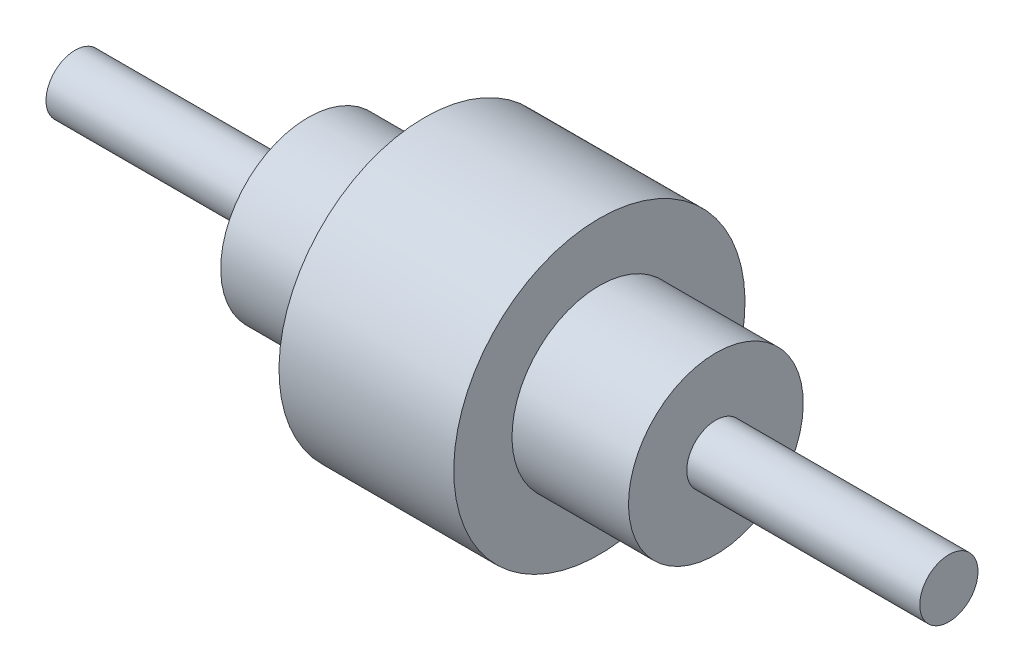
ISO-10303-21;
HEADER;
FILE_DESCRIPTION(('STEP AP214'),'2;1');
FILE_NAME('part.step','',(''),(''),'','','');
FILE_SCHEMA(('AUTOMOTIVE_DESIGN { 1 0 10303 214 1 1 1 1 }'));
ENDSEC;
DATA;
#1=APPLICATION_CONTEXT('core data for automotive mechanical design processes');
#2=APPLICATION_PROTOCOL_DEFINITION('international standard','automotive_design',2000,#1);
#3=PRODUCT_CONTEXT('',#1,'mechanical');
#4=PRODUCT('Part','Part','',(#3));
#5=PRODUCT_RELATED_PRODUCT_CATEGORY('part','',(#4));
#6=PRODUCT_DEFINITION_FORMATION('','',#4);
#7=PRODUCT_DEFINITION_CONTEXT('part definition',#1,'design');
#8=PRODUCT_DEFINITION('design','',#6,#7);
#9=PRODUCT_DEFINITION_SHAPE('','',#8);
#10=(LENGTH_UNIT() NAMED_UNIT(*) SI_UNIT(.MILLI.,.METRE.));
#11=(NAMED_UNIT(*) PLANE_ANGLE_UNIT() SI_UNIT($,.RADIAN.));
#12=(NAMED_UNIT(*) SI_UNIT($,.STERADIAN.) SOLID_ANGLE_UNIT());
#13=UNCERTAINTY_MEASURE_WITH_UNIT(LENGTH_MEASURE(1.E-05),#10,'distance_accuracy_value','');
#14=(GEOMETRIC_REPRESENTATION_CONTEXT(3) GLOBAL_UNCERTAINTY_ASSIGNED_CONTEXT((#13)) GLOBAL_UNIT_ASSIGNED_CONTEXT((#10,
#11,#12)) REPRESENTATION_CONTEXT('',''));
#15=CARTESIAN_POINT('',(0.,0.,0.));
#16=DIRECTION('',(0.,0.,1.));
#17=DIRECTION('',(1.,0.,0.));
#18=AXIS2_PLACEMENT_3D('',#15,#16,#17);
#19=CARTESIAN_POINT('',(150.,0.,0.));
#20=DIRECTION('',(1.,0.,0.));
#21=DIRECTION('',(0.,1.,0.));
#22=AXIS2_PLACEMENT_3D('',#19,#20,#21);
#23=CYLINDRICAL_SURFACE('',#22,50.);
#24=CARTESIAN_POINT('',(-30.,0.,0.));
#25=DIRECTION('',(1.,0.,0.));
#26=DIRECTION('',(0.,1.,0.));
#27=AXIS2_PLACEMENT_3D('',#24,#25,#26);
#28=CIRCLE('',#27,50.);
#29=CARTESIAN_POINT('',(-30.,50.,0.));
#30=VERTEX_POINT('',#29);
#31=EDGE_CURVE('E65',#30,#30,#28,.T.);
#32=ORIENTED_EDGE('',*,*,#31,.T.);
#33=EDGE_LOOP('',(#32));
#34=FACE_BOUND('',#33,.T.);
#35=CARTESIAN_POINT('',(30.,0.,0.));
#36=DIRECTION('',(1.,0.,0.));
#37=DIRECTION('',(0.,1.,0.));
#38=AXIS2_PLACEMENT_3D('',#35,#36,#37);
#39=CIRCLE('',#38,50.);
#40=CARTESIAN_POINT('',(30.,50.,0.));
#41=VERTEX_POINT('',#40);
#42=EDGE_CURVE('E10',#41,#41,#39,.T.);
#43=ORIENTED_EDGE('',*,*,#42,.F.);
#44=EDGE_LOOP('',(#43));
#45=FACE_BOUND('',#44,.T.);
#46=ADVANCED_FACE('F31',(#34,#45),#23,.T.);
#47=CARTESIAN_POINT('',(30.,50.,0.));
#48=DIRECTION('',(1.,0.,0.));
#49=DIRECTION('',(0.,1.,0.));
#50=AXIS2_PLACEMENT_3D('',#47,#48,#49);
#51=PLANE('',#50);
#52=ORIENTED_EDGE('',*,*,#42,.T.);
#53=EDGE_LOOP('',(#52));
#54=FACE_BOUND('',#53,.T.);
#55=CARTESIAN_POINT('',(30.,0.,0.));
#56=DIRECTION('',(1.,0.,0.));
#57=DIRECTION('',(0.,1.,0.));
#58=AXIS2_PLACEMENT_3D('',#55,#56,#57);
#59=CIRCLE('',#58,30.);
#60=CARTESIAN_POINT('',(30.,30.,0.));
#61=VERTEX_POINT('',#60);
#62=EDGE_CURVE('E37',#61,#61,#59,.T.);
#63=ORIENTED_EDGE('',*,*,#62,.F.);
#64=EDGE_LOOP('',(#63));
#65=FACE_BOUND('',#64,.T.);
#66=ADVANCED_FACE('F83',(#54,#65),#51,.T.);
#67=CARTESIAN_POINT('',(150.,0.,0.));
#68=DIRECTION('',(1.,0.,0.));
#69=DIRECTION('',(0.,1.,0.));
#70=AXIS2_PLACEMENT_3D('',#67,#68,#69);
#71=CYLINDRICAL_SURFACE('',#70,30.);
#72=ORIENTED_EDGE('',*,*,#62,.T.);
#73=EDGE_LOOP('',(#72));
#74=FACE_BOUND('',#73,.T.);
#75=CARTESIAN_POINT('',(70.,0.,0.));
#76=DIRECTION('',(1.,0.,0.));
#77=DIRECTION('',(0.,1.,0.));
#78=AXIS2_PLACEMENT_3D('',#75,#76,#77);
#79=CIRCLE('',#78,30.);
#80=CARTESIAN_POINT('',(70.,30.,0.));
#81=VERTEX_POINT('',#80);
#82=EDGE_CURVE('E41',#81,#81,#79,.T.);
#83=ORIENTED_EDGE('',*,*,#82,.F.);
#84=EDGE_LOOP('',(#83));
#85=FACE_BOUND('',#84,.T.);
#86=ADVANCED_FACE('F87',(#74,#85),#71,.T.);
#87=CARTESIAN_POINT('',(70.,30.,0.));
#88=DIRECTION('',(1.,0.,0.));
#89=DIRECTION('',(0.,1.,0.));
#90=AXIS2_PLACEMENT_3D('',#87,#88,#89);
#91=PLANE('',#90);
#92=ORIENTED_EDGE('',*,*,#82,.T.);
#93=EDGE_LOOP('',(#92));
#94=FACE_BOUND('',#93,.T.);
#95=CARTESIAN_POINT('',(70.,0.,0.));
#96=DIRECTION('',(1.,0.,0.));
#97=DIRECTION('',(0.,1.,0.));
#98=AXIS2_PLACEMENT_3D('',#95,#96,#97);
#99=CIRCLE('',#98,10.);
#100=CARTESIAN_POINT('',(70.,10.,0.));
#101=VERTEX_POINT('',#100);
#102=EDGE_CURVE('E45',#101,#101,#99,.T.);
#103=ORIENTED_EDGE('',*,*,#102,.F.);
#104=EDGE_LOOP('',(#103));
#105=FACE_BOUND('',#104,.T.);
#106=ADVANCED_FACE('F91',(#94,#105),#91,.T.);
#107=CARTESIAN_POINT('',(150.,0.,0.));
#108=DIRECTION('',(1.,0.,0.));
#109=DIRECTION('',(0.,1.,0.));
#110=AXIS2_PLACEMENT_3D('',#107,#108,#109);
#111=CYLINDRICAL_SURFACE('',#110,10.);
#112=ORIENTED_EDGE('',*,*,#102,.T.);
#113=EDGE_LOOP('',(#112));
#114=FACE_BOUND('',#113,.T.);
#115=CARTESIAN_POINT('',(150.,0.,0.));
#116=DIRECTION('',(1.,0.,0.));
#117=DIRECTION('',(0.,1.,0.));
#118=AXIS2_PLACEMENT_3D('',#115,#116,#117);
#119=CIRCLE('',#118,10.);
#120=CARTESIAN_POINT('',(150.,10.,0.));
#121=VERTEX_POINT('',#120);
#122=EDGE_CURVE('E50',#121,#121,#119,.T.);
#123=ORIENTED_EDGE('',*,*,#122,.F.);
#124=EDGE_LOOP('',(#123));
#125=FACE_BOUND('',#124,.T.);
#126=ADVANCED_FACE('F97',(#114,#125),#111,.T.);
#127=CARTESIAN_POINT('',(150.,10.,0.));
#128=DIRECTION('',(1.,0.,0.));
#129=DIRECTION('',(0.,1.,0.));
#130=AXIS2_PLACEMENT_3D('',#127,#128,#129);
#131=PLANE('',#130);
#132=ORIENTED_EDGE('',*,*,#122,.T.);
#133=EDGE_LOOP('',(#132));
#134=FACE_BOUND('',#133,.T.);
#135=ADVANCED_FACE('F101',(#134),#131,.T.);
#136=CARTESIAN_POINT('',(-150.,9.99999999999999,0.));
#137=DIRECTION('',(-1.,0.,0.));
#138=DIRECTION('',(0.,-1.,0.));
#139=AXIS2_PLACEMENT_3D('',#136,#137,#138);
#140=PLANE('',#139);
#141=CARTESIAN_POINT('',(-150.,0.,0.));
#142=DIRECTION('',(1.,0.,0.));
#143=DIRECTION('',(0.,1.,0.));
#144=AXIS2_PLACEMENT_3D('',#141,#142,#143);
#145=CIRCLE('',#144,10.);
#146=CARTESIAN_POINT('',(-150.,9.99999999999999,0.));
#147=VERTEX_POINT('',#146);
#148=EDGE_CURVE('E53',#147,#147,#145,.T.);
#149=ORIENTED_EDGE('',*,*,#148,.F.);
#150=EDGE_LOOP('',(#149));
#151=FACE_BOUND('',#150,.T.);
#152=ADVANCED_FACE('F105',(#151),#140,.T.);
#153=CARTESIAN_POINT('',(150.,0.,0.));
#154=DIRECTION('',(1.,0.,0.));
#155=DIRECTION('',(0.,1.,0.));
#156=AXIS2_PLACEMENT_3D('',#153,#154,#155);
#157=CYLINDRICAL_SURFACE('',#156,10.);
#158=ORIENTED_EDGE('',*,*,#148,.T.);
#159=EDGE_LOOP('',(#158));
#160=FACE_BOUND('',#159,.T.);
#161=CARTESIAN_POINT('',(-70.,0.,0.));
#162=DIRECTION('',(1.,0.,0.));
#163=DIRECTION('',(0.,1.,0.));
#164=AXIS2_PLACEMENT_3D('',#161,#162,#163);
#165=CIRCLE('',#164,10.);
#166=CARTESIAN_POINT('',(-70.,10.,0.));
#167=VERTEX_POINT('',#166);
#168=EDGE_CURVE('E56',#167,#167,#165,.T.);
#169=ORIENTED_EDGE('',*,*,#168,.F.);
#170=EDGE_LOOP('',(#169));
#171=FACE_BOUND('',#170,.T.);
#172=ADVANCED_FACE('F109',(#160,#171),#157,.T.);
#173=CARTESIAN_POINT('',(-70.,30.,0.));
#174=DIRECTION('',(-1.,0.,0.));
#175=DIRECTION('',(0.,-1.,0.));
#176=AXIS2_PLACEMENT_3D('',#173,#174,#175);
#177=PLANE('',#176);
#178=ORIENTED_EDGE('',*,*,#168,.T.);
#179=EDGE_LOOP('',(#178));
#180=FACE_BOUND('',#179,.T.);
#181=CARTESIAN_POINT('',(-70.,0.,0.));
#182=DIRECTION('',(1.,0.,0.));
#183=DIRECTION('',(0.,1.,0.));
#184=AXIS2_PLACEMENT_3D('',#181,#182,#183);
#185=CIRCLE('',#184,30.);
#186=CARTESIAN_POINT('',(-70.,30.,0.));
#187=VERTEX_POINT('',#186);
#188=EDGE_CURVE('E59',#187,#187,#185,.T.);
#189=ORIENTED_EDGE('',*,*,#188,.F.);
#190=EDGE_LOOP('',(#189));
#191=FACE_BOUND('',#190,.T.);
#192=ADVANCED_FACE('F79',(#180,#191),#177,.T.);
#193=CARTESIAN_POINT('',(150.,0.,0.));
#194=DIRECTION('',(1.,0.,0.));
#195=DIRECTION('',(0.,1.,0.));
#196=AXIS2_PLACEMENT_3D('',#193,#194,#195);
#197=CYLINDRICAL_SURFACE('',#196,30.);
#198=ORIENTED_EDGE('',*,*,#188,.T.);
#199=EDGE_LOOP('',(#198));
#200=FACE_BOUND('',#199,.T.);
#201=CARTESIAN_POINT('',(-30.,0.,0.));
#202=DIRECTION('',(1.,0.,0.));
#203=DIRECTION('',(0.,1.,0.));
#204=AXIS2_PLACEMENT_3D('',#201,#202,#203);
#205=CIRCLE('',#204,30.);
#206=CARTESIAN_POINT('',(-30.,30.,0.));
#207=VERTEX_POINT('',#206);
#208=EDGE_CURVE('E62',#207,#207,#205,.T.);
#209=ORIENTED_EDGE('',*,*,#208,.F.);
#210=EDGE_LOOP('',(#209));
#211=FACE_BOUND('',#210,.T.);
#212=ADVANCED_FACE('F73',(#200,#211),#197,.T.);
#213=CARTESIAN_POINT('',(-30.,30.,0.));
#214=DIRECTION('',(-1.,0.,0.));
#215=DIRECTION('',(0.,-1.,0.));
#216=AXIS2_PLACEMENT_3D('',#213,#214,#215);
#217=PLANE('',#216);
#218=ORIENTED_EDGE('',*,*,#208,.T.);
#219=EDGE_LOOP('',(#218));
#220=FACE_BOUND('',#219,.T.);
#221=ORIENTED_EDGE('',*,*,#31,.F.);
#222=EDGE_LOOP('',(#221));
#223=FACE_BOUND('',#222,.T.);
#224=ADVANCED_FACE('F71',(#220,#223),#217,.T.);
#225=CLOSED_SHELL('',(#46,#66,#86,#106,#126,#135,#152,#172,#192,#212,#224));
#226=MANIFOLD_SOLID_BREP('B2',#225);
#227=ADVANCED_BREP_SHAPE_REPRESENTATION('',(#18,#226),#14);
#228=SHAPE_DEFINITION_REPRESENTATION(#9,#227);
ENDSEC;
END-ISO-10303-21;
